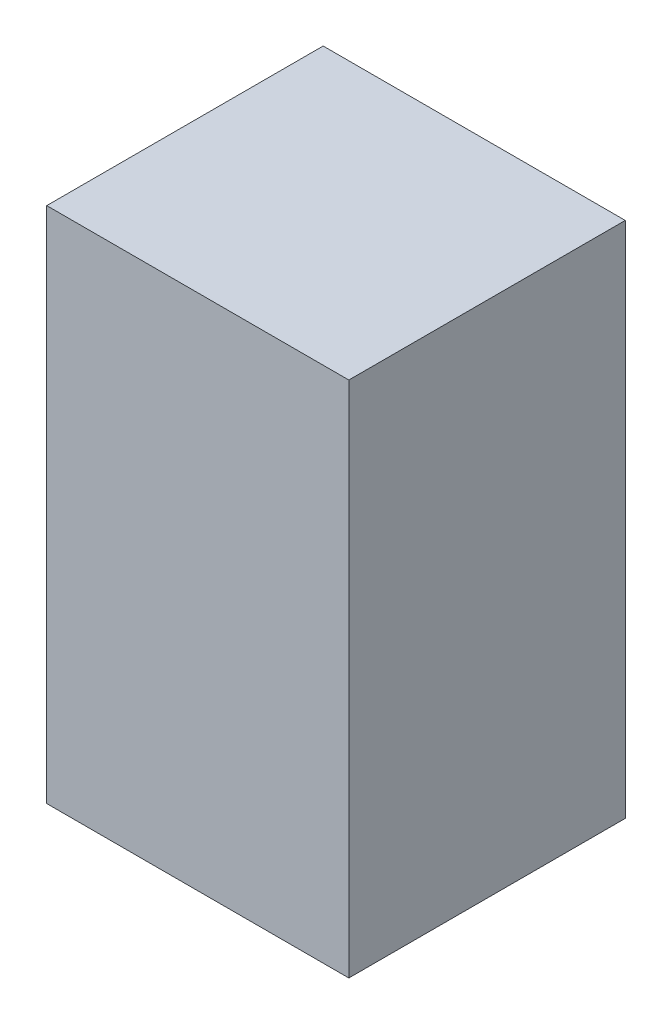
ISO-10303-21;
HEADER;
FILE_DESCRIPTION(('STEP AP214'),'2;1');
FILE_NAME('part.step','',(''),(''),'','','');
FILE_SCHEMA(('AUTOMOTIVE_DESIGN { 1 0 10303 214 1 1 1 1 }'));
ENDSEC;
DATA;
#1=APPLICATION_CONTEXT('core data for automotive mechanical design processes');
#2=APPLICATION_PROTOCOL_DEFINITION('international standard','automotive_design',2000,#1);
#3=PRODUCT_CONTEXT('',#1,'mechanical');
#4=PRODUCT('Part','Part','',(#3));
#5=PRODUCT_RELATED_PRODUCT_CATEGORY('part','',(#4));
#6=PRODUCT_DEFINITION_FORMATION('','',#4);
#7=PRODUCT_DEFINITION_CONTEXT('part definition',#1,'design');
#8=PRODUCT_DEFINITION('design','',#6,#7);
#9=PRODUCT_DEFINITION_SHAPE('','',#8);
#10=(LENGTH_UNIT() NAMED_UNIT(*) SI_UNIT(.MILLI.,.METRE.));
#11=(NAMED_UNIT(*) PLANE_ANGLE_UNIT() SI_UNIT($,.RADIAN.));
#12=(NAMED_UNIT(*) SI_UNIT($,.STERADIAN.) SOLID_ANGLE_UNIT());
#13=UNCERTAINTY_MEASURE_WITH_UNIT(LENGTH_MEASURE(1.E-05),#10,'distance_accuracy_value','');
#14=(GEOMETRIC_REPRESENTATION_CONTEXT(3) GLOBAL_UNCERTAINTY_ASSIGNED_CONTEXT((#13)) GLOBAL_UNIT_ASSIGNED_CONTEXT((#10,
#11,#12)) REPRESENTATION_CONTEXT('',''));
#15=CARTESIAN_POINT('',(0.,0.,0.));
#16=DIRECTION('',(0.,0.,1.));
#17=DIRECTION('',(1.,0.,0.));
#18=AXIS2_PLACEMENT_3D('',#15,#16,#17);
#19=CARTESIAN_POINT('',(-3.65090909090909,15.2881818181818,23.7));
#20=DIRECTION('',(1.,0.,0.));
#21=DIRECTION('',(0.,1.,0.));
#22=AXIS2_PLACEMENT_3D('',#19,#20,#21);
#23=PLANE('',#22);
#24=DIRECTION('',(0.,-1.,0.));
#25=VECTOR('',#24,1.);
#26=CARTESIAN_POINT('',(-3.65090909090909,15.2881818181818,0.));
#27=LINE('',#26,#25);
#28=CARTESIAN_POINT('',(-3.65090909090909,15.2881818181818,0.));
#29=VERTEX_POINT('',#28);
#30=CARTESIAN_POINT('',(-3.65090909090909,-29.1118181818182,0.));
#31=VERTEX_POINT('',#30);
#32=EDGE_CURVE('E105',#29,#31,#27,.T.);
#33=ORIENTED_EDGE('',*,*,#32,.T.);
#34=DIRECTION('',(0.,0.,-1.));
#35=VECTOR('',#34,1.);
#36=CARTESIAN_POINT('',(-3.65090909090909,-29.1118181818182,23.7));
#37=LINE('',#36,#35);
#38=CARTESIAN_POINT('',(-3.65090909090909,-29.1118181818182,23.7));
#39=VERTEX_POINT('',#38);
#40=EDGE_CURVE('E11',#39,#31,#37,.T.);
#41=ORIENTED_EDGE('',*,*,#40,.F.);
#42=DIRECTION('',(0.,-1.,0.));
#43=VECTOR('',#42,1.);
#44=CARTESIAN_POINT('',(-3.65090909090909,15.2881818181818,23.7));
#45=LINE('',#44,#43);
#46=CARTESIAN_POINT('',(-3.65090909090909,15.2881818181818,23.7));
#47=VERTEX_POINT('',#46);
#48=EDGE_CURVE('E93',#47,#39,#45,.T.);
#49=ORIENTED_EDGE('',*,*,#48,.F.);
#50=DIRECTION('',(0.,0.,-1.));
#51=VECTOR('',#50,1.);
#52=CARTESIAN_POINT('',(-3.65090909090909,15.2881818181818,23.7));
#53=LINE('',#52,#51);
#54=EDGE_CURVE('E101',#47,#29,#53,.T.);
#55=ORIENTED_EDGE('',*,*,#54,.T.);
#56=EDGE_LOOP('',(#33,#41,#49,#55));
#57=FACE_BOUND('',#56,.T.);
#58=ADVANCED_FACE('F42',(#57),#23,.F.);
#59=CARTESIAN_POINT('',(-3.65090909090909,-29.1118181818182,23.7));
#60=DIRECTION('',(0.,1.,0.));
#61=DIRECTION('',(0.,0.,1.));
#62=AXIS2_PLACEMENT_3D('',#59,#60,#61);
#63=PLANE('',#62);
#64=DIRECTION('',(1.,0.,0.));
#65=VECTOR('',#64,1.);
#66=CARTESIAN_POINT('',(-3.65090909090909,-29.1118181818182,0.));
#67=LINE('',#66,#65);
#68=CARTESIAN_POINT('',(22.2490909090909,-29.1118181818182,0.));
#69=VERTEX_POINT('',#68);
#70=EDGE_CURVE('E97',#31,#69,#67,.T.);
#71=ORIENTED_EDGE('',*,*,#70,.T.);
#72=DIRECTION('',(0.,0.,-1.));
#73=VECTOR('',#72,1.);
#74=CARTESIAN_POINT('',(22.2490909090909,-29.1118181818182,23.7));
#75=LINE('',#74,#73);
#76=CARTESIAN_POINT('',(22.2490909090909,-29.1118181818182,23.7));
#77=VERTEX_POINT('',#76);
#78=EDGE_CURVE('E50',#77,#69,#75,.T.);
#79=ORIENTED_EDGE('',*,*,#78,.F.);
#80=DIRECTION('',(1.,0.,0.));
#81=VECTOR('',#80,1.);
#82=CARTESIAN_POINT('',(-3.65090909090909,-29.1118181818182,23.7));
#83=LINE('',#82,#81);
#84=EDGE_CURVE('E88',#39,#77,#83,.T.);
#85=ORIENTED_EDGE('',*,*,#84,.F.);
#86=ORIENTED_EDGE('',*,*,#40,.T.);
#87=EDGE_LOOP('',(#71,#79,#85,#86));
#88=FACE_BOUND('',#87,.T.);
#89=ADVANCED_FACE('F96',(#88),#63,.F.);
#90=CARTESIAN_POINT('',(22.2490909090909,15.2881818181818,23.7));
#91=DIRECTION('',(-1.,0.,0.));
#92=DIRECTION('',(0.,-1.,0.));
#93=AXIS2_PLACEMENT_3D('',#90,#91,#92);
#94=PLANE('',#93);
#95=DIRECTION('',(0.,1.,0.));
#96=VECTOR('',#95,1.);
#97=CARTESIAN_POINT('',(22.2490909090909,15.2881818181818,0.));
#98=LINE('',#97,#96);
#99=CARTESIAN_POINT('',(22.2490909090909,15.2881818181818,0.));
#100=VERTEX_POINT('',#99);
#101=EDGE_CURVE('E75',#69,#100,#98,.T.);
#102=ORIENTED_EDGE('',*,*,#101,.T.);
#103=DIRECTION('',(0.,0.,-1.));
#104=VECTOR('',#103,1.);
#105=CARTESIAN_POINT('',(22.2490909090909,15.2881818181818,23.7));
#106=LINE('',#105,#104);
#107=CARTESIAN_POINT('',(22.2490909090909,15.2881818181818,23.7));
#108=VERTEX_POINT('',#107);
#109=EDGE_CURVE('E98',#108,#100,#106,.T.);
#110=ORIENTED_EDGE('',*,*,#109,.F.);
#111=DIRECTION('',(0.,1.,0.));
#112=VECTOR('',#111,1.);
#113=CARTESIAN_POINT('',(22.2490909090909,15.2881818181818,23.7));
#114=LINE('',#113,#112);
#115=EDGE_CURVE('E91',#77,#108,#114,.T.);
#116=ORIENTED_EDGE('',*,*,#115,.F.);
#117=ORIENTED_EDGE('',*,*,#78,.T.);
#118=EDGE_LOOP('',(#102,#110,#116,#117));
#119=FACE_BOUND('',#118,.T.);
#120=ADVANCED_FACE('F99',(#119),#94,.F.);
#121=CARTESIAN_POINT('',(-3.65090909090909,15.2881818181818,23.7));
#122=DIRECTION('',(0.,-1.,0.));
#123=DIRECTION('',(0.,0.,-1.));
#124=AXIS2_PLACEMENT_3D('',#121,#122,#123);
#125=PLANE('',#124);
#126=DIRECTION('',(-1.,0.,0.));
#127=VECTOR('',#126,1.);
#128=CARTESIAN_POINT('',(-3.65090909090909,15.2881818181818,0.));
#129=LINE('',#128,#127);
#130=EDGE_CURVE('E81',#100,#29,#129,.T.);
#131=ORIENTED_EDGE('',*,*,#130,.T.);
#132=ORIENTED_EDGE('',*,*,#54,.F.);
#133=DIRECTION('',(-1.,0.,0.));
#134=VECTOR('',#133,1.);
#135=CARTESIAN_POINT('',(-3.65090909090909,15.2881818181818,23.7));
#136=LINE('',#135,#134);
#137=EDGE_CURVE('E58',#108,#47,#136,.T.);
#138=ORIENTED_EDGE('',*,*,#137,.F.);
#139=ORIENTED_EDGE('',*,*,#109,.T.);
#140=EDGE_LOOP('',(#131,#132,#138,#139));
#141=FACE_BOUND('',#140,.T.);
#142=ADVANCED_FACE('F112',(#141),#125,.F.);
#143=CARTESIAN_POINT('',(0.,0.,23.7));
#144=DIRECTION('',(0.,0.,1.));
#145=DIRECTION('',(1.,0.,0.));
#146=AXIS2_PLACEMENT_3D('',#143,#144,#145);
#147=PLANE('',#146);
#148=ORIENTED_EDGE('',*,*,#48,.T.);
#149=ORIENTED_EDGE('',*,*,#84,.T.);
#150=ORIENTED_EDGE('',*,*,#115,.T.);
#151=ORIENTED_EDGE('',*,*,#137,.T.);
#152=EDGE_LOOP('',(#148,#149,#150,#151));
#153=FACE_BOUND('',#152,.T.);
#154=ADVANCED_FACE('F89',(#153),#147,.T.);
#155=CARTESIAN_POINT('',(0.,0.,0.));
#156=DIRECTION('',(0.,0.,1.));
#157=DIRECTION('',(1.,0.,0.));
#158=AXIS2_PLACEMENT_3D('',#155,#156,#157);
#159=PLANE('',#158);
#160=ORIENTED_EDGE('',*,*,#32,.F.);
#161=ORIENTED_EDGE('',*,*,#130,.F.);
#162=ORIENTED_EDGE('',*,*,#101,.F.);
#163=ORIENTED_EDGE('',*,*,#70,.F.);
#164=EDGE_LOOP('',(#160,#161,#162,#163));
#165=FACE_BOUND('',#164,.T.);
#166=ADVANCED_FACE('F115',(#165),#159,.F.);
#167=CLOSED_SHELL('',(#58,#89,#120,#142,#154,#166));
#168=MANIFOLD_SOLID_BREP('B2',#167);
#169=ADVANCED_BREP_SHAPE_REPRESENTATION('',(#18,#168),#14);
#170=SHAPE_DEFINITION_REPRESENTATION(#9,#169);
ENDSEC;
END-ISO-10303-21;
